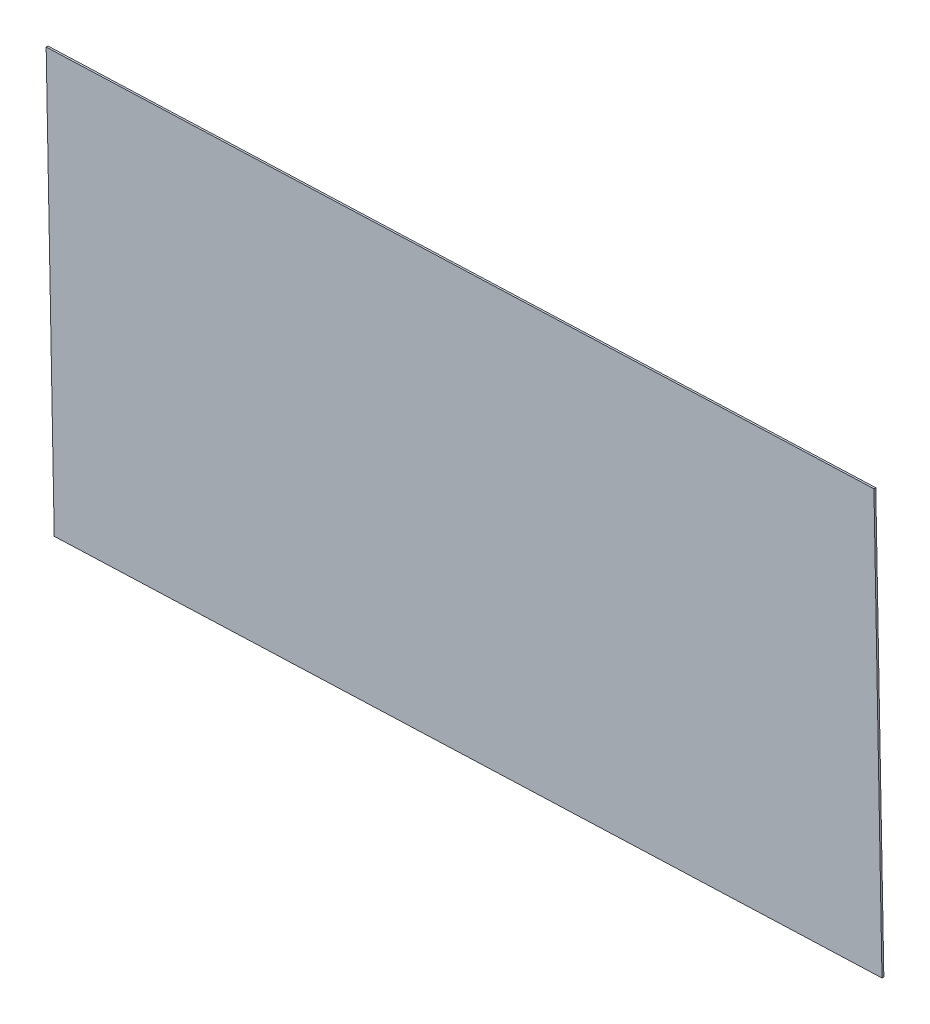
ISO-10303-21;
HEADER;
FILE_DESCRIPTION(('STEP AP214'),'2;1');
FILE_NAME('part.step','',(''),(''),'','','');
FILE_SCHEMA(('AUTOMOTIVE_DESIGN { 1 0 10303 214 1 1 1 1 }'));
ENDSEC;
DATA;
#1=APPLICATION_CONTEXT('core data for automotive mechanical design processes');
#2=APPLICATION_PROTOCOL_DEFINITION('international standard','automotive_design',2000,#1);
#3=PRODUCT_CONTEXT('',#1,'mechanical');
#4=PRODUCT('Part','Part','',(#3));
#5=PRODUCT_RELATED_PRODUCT_CATEGORY('part','',(#4));
#6=PRODUCT_DEFINITION_FORMATION('','',#4);
#7=PRODUCT_DEFINITION_CONTEXT('part definition',#1,'design');
#8=PRODUCT_DEFINITION('design','',#6,#7);
#9=PRODUCT_DEFINITION_SHAPE('','',#8);
#10=(LENGTH_UNIT() NAMED_UNIT(*) SI_UNIT(.MILLI.,.METRE.));
#11=(NAMED_UNIT(*) PLANE_ANGLE_UNIT() SI_UNIT($,.RADIAN.));
#12=(NAMED_UNIT(*) SI_UNIT($,.STERADIAN.) SOLID_ANGLE_UNIT());
#13=UNCERTAINTY_MEASURE_WITH_UNIT(LENGTH_MEASURE(1.E-05),#10,'distance_accuracy_value','');
#14=(GEOMETRIC_REPRESENTATION_CONTEXT(3) GLOBAL_UNCERTAINTY_ASSIGNED_CONTEXT((#13)) GLOBAL_UNIT_ASSIGNED_CONTEXT((#10,
#11,#12)) REPRESENTATION_CONTEXT('',''));
#15=CARTESIAN_POINT('',(0.,0.,0.));
#16=DIRECTION('',(0.,0.,1.));
#17=DIRECTION('',(1.,0.,0.));
#18=AXIS2_PLACEMENT_3D('',#15,#16,#17);
#19=CARTESIAN_POINT('',(-620.667237692327,591.594402696659,-47.8273031661953));
#20=DIRECTION('',(-0.99955894153921,-0.0277726394472756,0.0105167907246131));
#21=DIRECTION('',(0.0277741754417441,-0.999614223177387,0.));
#22=AXIS2_PLACEMENT_3D('',#19,#20,#21);
#23=PLANE('',#22);
#24=DIRECTION('',(0.0278622924152516,-0.999575831843987,0.00847638217452089));
#25=VECTOR('',#24,1.);
#26=CARTESIAN_POINT('',(-620.634608476627,591.622233684599,-44.6525928218657));
#27=LINE('',#26,#25);
#28=CARTESIAN_POINT('',(-620.634608476627,591.622233684599,-44.6525928218657));
#29=VERTEX_POINT('',#28);
#30=CARTESIAN_POINT('',(-600.8189461109,-119.276097922845,-38.6241898193464));
#31=VERTEX_POINT('',#30);
#32=EDGE_CURVE('E101',#29,#31,#27,.T.);
#33=ORIENTED_EDGE('',*,*,#32,.F.);
#34=DIRECTION('',(0.010276918330934,0.00876566549288511,0.999908769867574));
#35=VECTOR('',#34,1.);
#36=CARTESIAN_POINT('',(-620.667237692327,591.594402696659,-47.8273031661953));
#37=LINE('',#36,#35);
#38=CARTESIAN_POINT('',(-620.667237692327,591.594402696659,-47.8273031661953));
#39=VERTEX_POINT('',#38);
#40=EDGE_CURVE('E11',#39,#29,#37,.T.);
#41=ORIENTED_EDGE('',*,*,#40,.F.);
#42=DIRECTION('',(0.0278622924152516,-0.999575831843987,0.00847638217452089));
#43=VECTOR('',#42,1.);
#44=CARTESIAN_POINT('',(-620.667237692327,591.594402696659,-47.8273031661953));
#45=LINE('',#44,#43);
#46=CARTESIAN_POINT('',(-600.8515753266,-119.303928910784,-41.798900163676));
#47=VERTEX_POINT('',#46);
#48=EDGE_CURVE('E95',#39,#47,#45,.T.);
#49=ORIENTED_EDGE('',*,*,#48,.T.);
#50=DIRECTION('',(0.010276918330934,0.00876566549288511,0.999908769867574));
#51=VECTOR('',#50,1.);
#52=CARTESIAN_POINT('',(-600.8515753266,-119.303928910784,-41.798900163676));
#53=LINE('',#52,#51);
#54=EDGE_CURVE('E40',#47,#31,#53,.T.);
#55=ORIENTED_EDGE('',*,*,#54,.T.);
#56=EDGE_LOOP('',(#33,#41,#49,#55));
#57=FACE_BOUND('',#56,.T.);
#58=ADVANCED_FACE('F37',(#57),#23,.T.);
#59=CARTESIAN_POINT('',(-620.667237692327,591.594402696659,-47.8273031661953));
#60=DIRECTION('',(-0.0278622924152515,0.999575831843987,-0.0084763821745209));
#61=DIRECTION('',(-0.999611743068483,-0.0278632934088791,0.));
#62=AXIS2_PLACEMENT_3D('',#59,#60,#61);
#63=PLANE('',#62);
#64=DIRECTION('',(-0.99955894153921,-0.0277726394472755,0.0105167907246131));
#65=VECTOR('',#64,1.);
#66=CARTESIAN_POINT('',(-620.634608476627,591.622233684599,-44.6525928218657));
#67=LINE('',#66,#65);
#68=CARTESIAN_POINT('',(778.747909678267,630.503928910785,-59.376099836324));
#69=VERTEX_POINT('',#68);
#70=EDGE_CURVE('E97',#69,#29,#67,.T.);
#71=ORIENTED_EDGE('',*,*,#70,.F.);
#72=DIRECTION('',(0.010276918330934,0.00876566549288511,0.999908769867574));
#73=VECTOR('',#72,1.);
#74=CARTESIAN_POINT('',(778.715280462567,630.476097922845,-62.5508101806535));
#75=LINE('',#74,#73);
#76=CARTESIAN_POINT('',(778.715280462567,630.476097922845,-62.5508101806535));
#77=VERTEX_POINT('',#76);
#78=EDGE_CURVE('E46',#77,#69,#75,.T.);
#79=ORIENTED_EDGE('',*,*,#78,.F.);
#80=DIRECTION('',(-0.99955894153921,-0.0277726394472755,0.0105167907246131));
#81=VECTOR('',#80,1.);
#82=CARTESIAN_POINT('',(-620.667237692327,591.594402696659,-47.8273031661953));
#83=LINE('',#82,#81);
#84=EDGE_CURVE('E92',#77,#39,#83,.T.);
#85=ORIENTED_EDGE('',*,*,#84,.T.);
#86=ORIENTED_EDGE('',*,*,#40,.T.);
#87=EDGE_LOOP('',(#71,#79,#85,#86));
#88=FACE_BOUND('',#87,.T.);
#89=ADVANCED_FACE('F111',(#88),#63,.T.);
#90=CARTESIAN_POINT('',(778.715280462567,630.476097922845,-62.5508101806535));
#91=DIRECTION('',(0.99955894153921,0.0277726394472756,-0.0105167907246131));
#92=DIRECTION('',(-0.0277741754417441,0.999614223177387,0.));
#93=AXIS2_PLACEMENT_3D('',#90,#91,#92);
#94=PLANE('',#93);
#95=DIRECTION('',(-0.0278622924152516,0.999575831843987,-0.00847638217452089));
#96=VECTOR('',#95,1.);
#97=CARTESIAN_POINT('',(778.747909678267,630.503928910785,-59.376099836324));
#98=LINE('',#97,#96);
#99=CARTESIAN_POINT('',(798.563572043994,-80.394402696659,-53.3476968338047));
#100=VERTEX_POINT('',#99);
#101=EDGE_CURVE('E87',#100,#69,#98,.T.);
#102=ORIENTED_EDGE('',*,*,#101,.F.);
#103=DIRECTION('',(0.010276918330934,0.00876566549288511,0.999908769867574));
#104=VECTOR('',#103,1.);
#105=CARTESIAN_POINT('',(798.530942828294,-80.4222336845989,-56.5224071781343));
#106=LINE('',#105,#104);
#107=CARTESIAN_POINT('',(798.530942828294,-80.4222336845989,-56.5224071781343));
#108=VERTEX_POINT('',#107);
#109=EDGE_CURVE('E82',#108,#100,#106,.T.);
#110=ORIENTED_EDGE('',*,*,#109,.F.);
#111=DIRECTION('',(-0.0278622924152516,0.999575831843987,-0.00847638217452089));
#112=VECTOR('',#111,1.);
#113=CARTESIAN_POINT('',(778.715280462567,630.476097922845,-62.5508101806535));
#114=LINE('',#113,#112);
#115=EDGE_CURVE('E85',#108,#77,#114,.T.);
#116=ORIENTED_EDGE('',*,*,#115,.T.);
#117=ORIENTED_EDGE('',*,*,#78,.T.);
#118=EDGE_LOOP('',(#102,#110,#116,#117));
#119=FACE_BOUND('',#118,.T.);
#120=ADVANCED_FACE('F84',(#119),#94,.T.);
#121=CARTESIAN_POINT('',(-600.8515753266,-119.303928910784,-41.798900163676));
#122=DIRECTION('',(0.0278622924152515,-0.999575831843987,0.0084763821745209));
#123=DIRECTION('',(0.999611743068483,0.027863293408879,0.));
#124=AXIS2_PLACEMENT_3D('',#121,#122,#123);
#125=PLANE('',#124);
#126=DIRECTION('',(0.99955894153921,0.0277726394472754,-0.0105167907246131));
#127=VECTOR('',#126,1.);
#128=CARTESIAN_POINT('',(-600.8189461109,-119.276097922845,-38.6241898193464));
#129=LINE('',#128,#127);
#130=EDGE_CURVE('E104',#31,#100,#129,.T.);
#131=ORIENTED_EDGE('',*,*,#130,.F.);
#132=ORIENTED_EDGE('',*,*,#54,.F.);
#133=DIRECTION('',(0.99955894153921,0.0277726394472754,-0.0105167907246131));
#134=VECTOR('',#133,1.);
#135=CARTESIAN_POINT('',(-600.8515753266,-119.303928910784,-41.798900163676));
#136=LINE('',#135,#134);
#137=EDGE_CURVE('E91',#47,#108,#136,.T.);
#138=ORIENTED_EDGE('',*,*,#137,.T.);
#139=ORIENTED_EDGE('',*,*,#109,.T.);
#140=EDGE_LOOP('',(#131,#132,#138,#139));
#141=FACE_BOUND('',#140,.T.);
#142=ADVANCED_FACE('F94',(#141),#125,.T.);
#143=CARTESIAN_POINT('',(-0.503731042053075,-0.429655823937876,-49.0112960309598));
#144=DIRECTION('',(0.010276918330934,0.00876566549288511,0.999908769867575));
#145=DIRECTION('',(0.999947187022327,0.,-0.0102773131769177));
#146=AXIS2_PLACEMENT_3D('',#143,#144,#145);
#147=PLANE('',#146);
#148=ORIENTED_EDGE('',*,*,#48,.F.);
#149=ORIENTED_EDGE('',*,*,#84,.F.);
#150=ORIENTED_EDGE('',*,*,#115,.F.);
#151=ORIENTED_EDGE('',*,*,#137,.F.);
#152=EDGE_LOOP('',(#148,#149,#150,#151));
#153=FACE_BOUND('',#152,.T.);
#154=ADVANCED_FACE('F90',(#153),#147,.F.);
#155=CARTESIAN_POINT('',(-0.471101826352359,-0.401824835997966,-45.8365856866302));
#156=DIRECTION('',(0.010276918330934,0.00876566549288511,0.999908769867575));
#157=DIRECTION('',(0.999947187022327,0.,-0.0102773131769177));
#158=AXIS2_PLACEMENT_3D('',#155,#156,#157);
#159=PLANE('',#158);
#160=ORIENTED_EDGE('',*,*,#32,.T.);
#161=ORIENTED_EDGE('',*,*,#130,.T.);
#162=ORIENTED_EDGE('',*,*,#101,.T.);
#163=ORIENTED_EDGE('',*,*,#70,.T.);
#164=EDGE_LOOP('',(#160,#161,#162,#163));
#165=FACE_BOUND('',#164,.T.);
#166=ADVANCED_FACE('F110',(#165),#159,.T.);
#167=CLOSED_SHELL('',(#58,#89,#120,#142,#154,#166));
#168=MANIFOLD_SOLID_BREP('B2',#167);
#169=ADVANCED_BREP_SHAPE_REPRESENTATION('',(#18,#168),#14);
#170=SHAPE_DEFINITION_REPRESENTATION(#9,#169);
ENDSEC;
END-ISO-10303-21;
